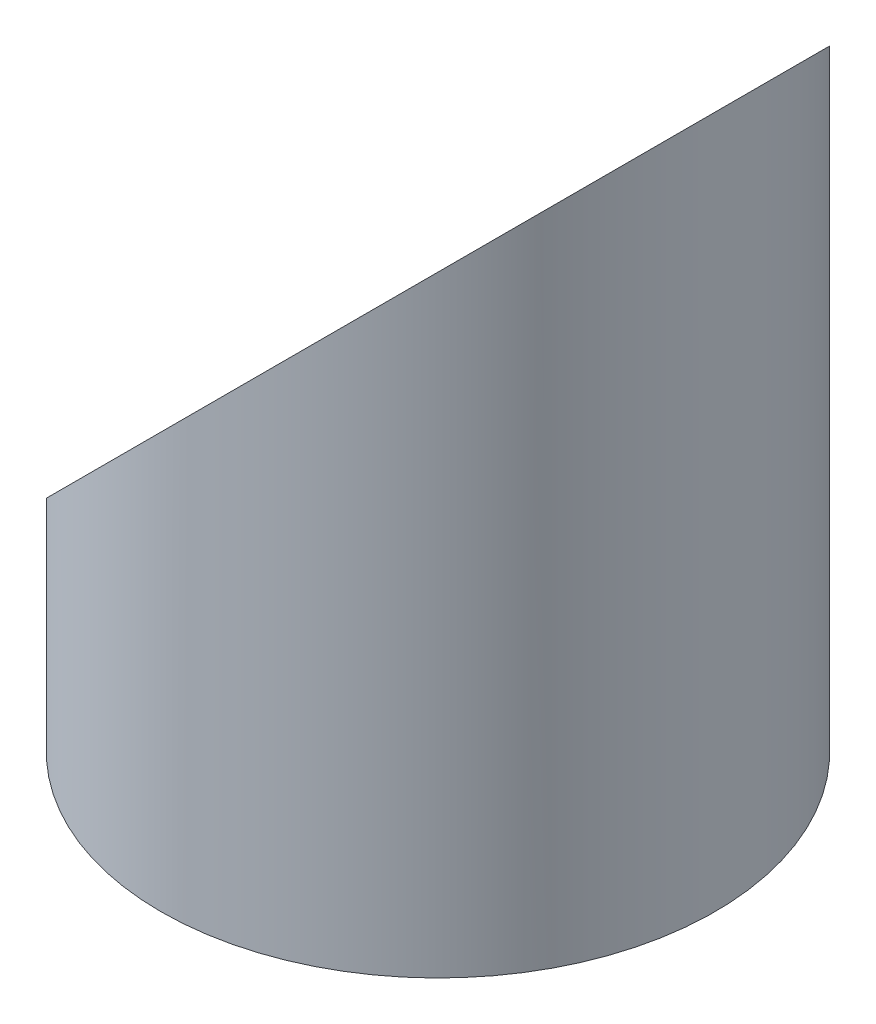
ISO-10303-21;
HEADER;
FILE_DESCRIPTION(('STEP AP214'),'2;1');
FILE_NAME('part.step','',(''),(''),'','','');
FILE_SCHEMA(('AUTOMOTIVE_DESIGN { 1 0 10303 214 1 1 1 1 }'));
ENDSEC;
DATA;
#1=APPLICATION_CONTEXT('core data for automotive mechanical design processes');
#2=APPLICATION_PROTOCOL_DEFINITION('international standard','automotive_design',2000,#1);
#3=PRODUCT_CONTEXT('',#1,'mechanical');
#4=PRODUCT('Part','Part','',(#3));
#5=PRODUCT_RELATED_PRODUCT_CATEGORY('part','',(#4));
#6=PRODUCT_DEFINITION_FORMATION('','',#4);
#7=PRODUCT_DEFINITION_CONTEXT('part definition',#1,'design');
#8=PRODUCT_DEFINITION('design','',#6,#7);
#9=PRODUCT_DEFINITION_SHAPE('','',#8);
#10=(LENGTH_UNIT() NAMED_UNIT(*) SI_UNIT(.MILLI.,.METRE.));
#11=(NAMED_UNIT(*) PLANE_ANGLE_UNIT() SI_UNIT($,.RADIAN.));
#12=(NAMED_UNIT(*) SI_UNIT($,.STERADIAN.) SOLID_ANGLE_UNIT());
#13=UNCERTAINTY_MEASURE_WITH_UNIT(LENGTH_MEASURE(1.E-05),#10,'distance_accuracy_value','');
#14=(GEOMETRIC_REPRESENTATION_CONTEXT(3) GLOBAL_UNCERTAINTY_ASSIGNED_CONTEXT((#13)) GLOBAL_UNIT_ASSIGNED_CONTEXT((#10,
#11,#12)) REPRESENTATION_CONTEXT('',''));
#15=CARTESIAN_POINT('',(0.,0.,0.));
#16=DIRECTION('',(0.,0.,1.));
#17=DIRECTION('',(1.,0.,0.));
#18=AXIS2_PLACEMENT_3D('',#15,#16,#17);
#19=CARTESIAN_POINT('',(0.,100.,0.));
#20=DIRECTION('',(0.,-1.,0.));
#21=DIRECTION('',(0.,0.,-1.));
#22=AXIS2_PLACEMENT_3D('',#19,#20,#21);
#23=CYLINDRICAL_SURFACE('',#22,40.);
#24=CARTESIAN_POINT('',(0.,0.,0.));
#25=DIRECTION('',(0.,1.,0.));
#26=DIRECTION('',(0.,0.,1.));
#27=AXIS2_PLACEMENT_3D('',#24,#25,#26);
#28=CIRCLE('',#27,40.);
#29=CARTESIAN_POINT('',(0.,0.,40.));
#30=VERTEX_POINT('',#29);
#31=EDGE_CURVE('E40',#30,#30,#28,.T.);
#32=ORIENTED_EDGE('',*,*,#31,.T.);
#33=EDGE_LOOP('',(#32));
#34=FACE_BOUND('',#33,.T.);
#35=CARTESIAN_POINT('',(0.,60.,0.));
#36=DIRECTION('',(0.707106781186548,-0.707106781186547,0.));
#37=DIRECTION('',(-0.707106781186547,-0.707106781186548,0.));
#38=AXIS2_PLACEMENT_3D('',#35,#36,#37);
#39=ELLIPSE('',#38,56.5685424949238,40.);
#40=CARTESIAN_POINT('',(-40.,20.,0.));
#41=VERTEX_POINT('',#40);
#42=EDGE_CURVE('E109',#41,#41,#39,.T.);
#43=ORIENTED_EDGE('',*,*,#42,.T.);
#44=EDGE_LOOP('',(#43));
#45=FACE_BOUND('',#44,.T.);
#46=ADVANCED_FACE('F33',(#34,#45),#23,.T.);
#47=CARTESIAN_POINT('',(0.,0.,0.));
#48=DIRECTION('',(0.,1.,0.));
#49=DIRECTION('',(0.,0.,1.));
#50=AXIS2_PLACEMENT_3D('',#47,#48,#49);
#51=PLANE('',#50);
#52=ORIENTED_EDGE('',*,*,#31,.F.);
#53=EDGE_LOOP('',(#52));
#54=FACE_BOUND('',#53,.T.);
#55=DIRECTION('',(0.70710678118655,0.,-0.707106781186545));
#56=VECTOR('',#55,1.);
#57=CARTESIAN_POINT('',(0.,0.,20.));
#58=LINE('',#57,#56);
#59=CARTESIAN_POINT('',(0.,0.,20.));
#60=VERTEX_POINT('',#59);
#61=CARTESIAN_POINT('',(20.0000000000001,0.,0.));
#62=VERTEX_POINT('',#61);
#63=EDGE_CURVE('E105',#60,#62,#58,.T.);
#64=ORIENTED_EDGE('',*,*,#63,.T.);
#65=DIRECTION('',(-0.707106781186548,0.,-0.707106781186547));
#66=VECTOR('',#65,1.);
#67=CARTESIAN_POINT('',(20.0000000000001,0.,0.));
#68=LINE('',#67,#66);
#69=CARTESIAN_POINT('',(1.32859137527896E-13,0.,-20.));
#70=VERTEX_POINT('',#69);
#71=EDGE_CURVE('E107',#62,#70,#68,.T.);
#72=ORIENTED_EDGE('',*,*,#71,.T.);
#73=DIRECTION('',(-0.70710678118655,0.,0.707106781186545));
#74=VECTOR('',#73,1.);
#75=CARTESIAN_POINT('',(-20.,0.,0.));
#76=LINE('',#75,#74);
#77=CARTESIAN_POINT('',(-20.,0.,0.));
#78=VERTEX_POINT('',#77);
#79=EDGE_CURVE('E111',#70,#78,#76,.T.);
#80=ORIENTED_EDGE('',*,*,#79,.T.);
#81=DIRECTION('',(0.707106781186548,0.,0.707106781186548));
#82=VECTOR('',#81,1.);
#83=CARTESIAN_POINT('',(0.,0.,20.));
#84=LINE('',#83,#82);
#85=EDGE_CURVE('E86',#78,#60,#84,.T.);
#86=ORIENTED_EDGE('',*,*,#85,.T.);
#87=EDGE_LOOP('',(#64,#72,#80,#86));
#88=FACE_BOUND('',#87,.T.);
#89=ADVANCED_FACE('F99',(#54,#88),#51,.F.);
#90=CARTESIAN_POINT('',(0.,100.,20.));
#91=DIRECTION('',(-0.707106781186545,0.,-0.70710678118655));
#92=DIRECTION('',(-0.70710678118655,0.,0.707106781186545));
#93=AXIS2_PLACEMENT_3D('',#90,#91,#92);
#94=PLANE('',#93);
#95=DIRECTION('',(-0.577350269189627,-0.577350269189627,0.577350269189623));
#96=VECTOR('',#95,1.);
#97=CARTESIAN_POINT('',(13.3333333333334,73.3333333333334,6.6666666666667));
#98=LINE('',#97,#96);
#99=CARTESIAN_POINT('',(20.0000000000001,80.0000000000002,0.));
#100=VERTEX_POINT('',#99);
#101=CARTESIAN_POINT('',(0.,60.,20.));
#102=VERTEX_POINT('',#101);
#103=EDGE_CURVE('E46',#100,#102,#98,.T.);
#104=ORIENTED_EDGE('',*,*,#103,.F.);
#105=DIRECTION('',(0.,-1.,0.));
#106=VECTOR('',#105,1.);
#107=CARTESIAN_POINT('',(20.0000000000001,100.,0.));
#108=LINE('',#107,#106);
#109=EDGE_CURVE('E89',#100,#62,#108,.T.);
#110=ORIENTED_EDGE('',*,*,#109,.T.);
#111=ORIENTED_EDGE('',*,*,#63,.F.);
#112=DIRECTION('',(0.,-1.,0.));
#113=VECTOR('',#112,1.);
#114=CARTESIAN_POINT('',(0.,100.,20.));
#115=LINE('',#114,#113);
#116=EDGE_CURVE('E53',#102,#60,#115,.T.);
#117=ORIENTED_EDGE('',*,*,#116,.F.);
#118=EDGE_LOOP('',(#104,#110,#111,#117));
#119=FACE_BOUND('',#118,.T.);
#120=ADVANCED_FACE('F102',(#119),#94,.T.);
#121=CARTESIAN_POINT('',(20.0000000000001,100.,0.));
#122=DIRECTION('',(-0.707106781186547,0.,0.707106781186548));
#123=DIRECTION('',(0.707106781186548,0.,0.707106781186547));
#124=AXIS2_PLACEMENT_3D('',#121,#122,#123);
#125=PLANE('',#124);
#126=DIRECTION('',(0.577350269189626,0.577350269189626,0.577350269189626));
#127=VECTOR('',#126,1.);
#128=CARTESIAN_POINT('',(26.6666666666668,86.6666666666668,6.66666666666662));
#129=LINE('',#128,#127);
#130=CARTESIAN_POINT('',(1.32859137687168E-13,60.0000000000001,-20.));
#131=VERTEX_POINT('',#130);
#132=EDGE_CURVE('E82',#131,#100,#129,.T.);
#133=ORIENTED_EDGE('',*,*,#132,.F.);
#134=DIRECTION('',(0.,-1.,0.));
#135=VECTOR('',#134,1.);
#136=CARTESIAN_POINT('',(1.32859137527896E-13,100.,-20.));
#137=LINE('',#136,#135);
#138=EDGE_CURVE('E81',#131,#70,#137,.T.);
#139=ORIENTED_EDGE('',*,*,#138,.T.);
#140=ORIENTED_EDGE('',*,*,#71,.F.);
#141=ORIENTED_EDGE('',*,*,#109,.F.);
#142=EDGE_LOOP('',(#133,#139,#140,#141));
#143=FACE_BOUND('',#142,.T.);
#144=ADVANCED_FACE('F120',(#143),#125,.T.);
#145=CARTESIAN_POINT('',(-20.,100.,0.));
#146=DIRECTION('',(0.707106781186545,0.,0.70710678118655));
#147=DIRECTION('',(0.70710678118655,0.,-0.707106781186545));
#148=AXIS2_PLACEMENT_3D('',#145,#146,#147);
#149=PLANE('',#148);
#150=DIRECTION('',(0.577350269189627,0.577350269189627,-0.577350269189623));
#151=VECTOR('',#150,1.);
#152=CARTESIAN_POINT('',(0.,60.0000000000001,-20.));
#153=LINE('',#152,#151);
#154=CARTESIAN_POINT('',(-20.,40.,0.));
#155=VERTEX_POINT('',#154);
#156=EDGE_CURVE('E73',#155,#131,#153,.T.);
#157=ORIENTED_EDGE('',*,*,#156,.F.);
#158=DIRECTION('',(0.,-1.,0.));
#159=VECTOR('',#158,1.);
#160=CARTESIAN_POINT('',(-20.,100.,0.));
#161=LINE('',#160,#159);
#162=EDGE_CURVE('E80',#155,#78,#161,.T.);
#163=ORIENTED_EDGE('',*,*,#162,.T.);
#164=ORIENTED_EDGE('',*,*,#79,.F.);
#165=ORIENTED_EDGE('',*,*,#138,.F.);
#166=EDGE_LOOP('',(#157,#163,#164,#165));
#167=FACE_BOUND('',#166,.T.);
#168=ADVANCED_FACE('F78',(#167),#149,.T.);
#169=CARTESIAN_POINT('',(0.,100.,20.));
#170=DIRECTION('',(0.707106781186548,0.,-0.707106781186548));
#171=DIRECTION('',(-0.707106781186548,0.,-0.707106781186548));
#172=AXIS2_PLACEMENT_3D('',#169,#170,#171);
#173=PLANE('',#172);
#174=DIRECTION('',(-0.577350269189626,-0.577350269189626,-0.577350269189626));
#175=VECTOR('',#174,1.);
#176=CARTESIAN_POINT('',(13.3333333333333,73.3333333333333,33.3333333333333));
#177=LINE('',#176,#175);
#178=EDGE_CURVE('E11',#102,#155,#177,.T.);
#179=ORIENTED_EDGE('',*,*,#178,.F.);
#180=ORIENTED_EDGE('',*,*,#116,.T.);
#181=ORIENTED_EDGE('',*,*,#85,.F.);
#182=ORIENTED_EDGE('',*,*,#162,.F.);
#183=EDGE_LOOP('',(#179,#180,#181,#182));
#184=FACE_BOUND('',#183,.T.);
#185=ADVANCED_FACE('F84',(#184),#173,.T.);
#186=CARTESIAN_POINT('',(-40.,20.,-40.));
#187=DIRECTION('',(0.707106781186548,-0.707106781186547,0.));
#188=DIRECTION('',(0.707106781186547,0.707106781186548,0.));
#189=AXIS2_PLACEMENT_3D('',#186,#187,#188);
#190=PLANE('',#189);
#191=ORIENTED_EDGE('',*,*,#103,.T.);
#192=ORIENTED_EDGE('',*,*,#178,.T.);
#193=ORIENTED_EDGE('',*,*,#156,.T.);
#194=ORIENTED_EDGE('',*,*,#132,.T.);
#195=EDGE_LOOP('',(#191,#192,#193,#194));
#196=FACE_BOUND('',#195,.T.);
#197=ORIENTED_EDGE('',*,*,#42,.F.);
#198=EDGE_LOOP('',(#197));
#199=FACE_BOUND('',#198,.T.);
#200=ADVANCED_FACE('F71',(#196,#199),#190,.F.);
#201=CLOSED_SHELL('',(#46,#89,#120,#144,#168,#185,#200));
#202=MANIFOLD_SOLID_BREP('B2',#201);
#203=ADVANCED_BREP_SHAPE_REPRESENTATION('',(#18,#202),#14);
#204=SHAPE_DEFINITION_REPRESENTATION(#9,#203);
ENDSEC;
END-ISO-10303-21;
